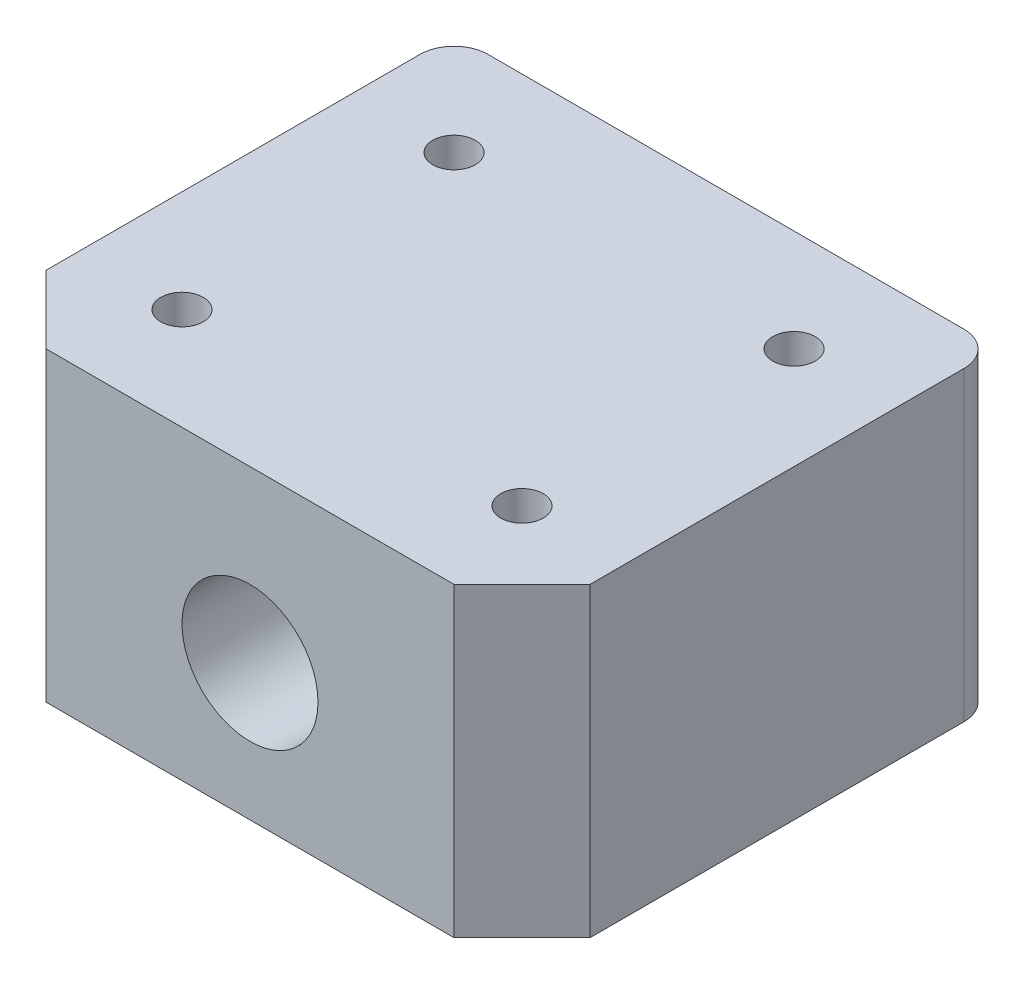
ISO-10303-21;
HEADER;
FILE_DESCRIPTION(('STEP AP214'),'2;1');
FILE_NAME('part.step','',(''),(''),'','','');
FILE_SCHEMA(('AUTOMOTIVE_DESIGN { 1 0 10303 214 1 1 1 1 }'));
ENDSEC;
DATA;
#1=APPLICATION_CONTEXT('core data for automotive mechanical design processes');
#2=APPLICATION_PROTOCOL_DEFINITION('international standard','automotive_design',2000,#1);
#3=PRODUCT_CONTEXT('',#1,'mechanical');
#4=PRODUCT('Part','Part','',(#3));
#5=PRODUCT_RELATED_PRODUCT_CATEGORY('part','',(#4));
#6=PRODUCT_DEFINITION_FORMATION('','',#4);
#7=PRODUCT_DEFINITION_CONTEXT('part definition',#1,'design');
#8=PRODUCT_DEFINITION('design','',#6,#7);
#9=PRODUCT_DEFINITION_SHAPE('','',#8);
#10=(LENGTH_UNIT() NAMED_UNIT(*) SI_UNIT(.MILLI.,.METRE.));
#11=(NAMED_UNIT(*) PLANE_ANGLE_UNIT() SI_UNIT($,.RADIAN.));
#12=(NAMED_UNIT(*) SI_UNIT($,.STERADIAN.) SOLID_ANGLE_UNIT());
#13=UNCERTAINTY_MEASURE_WITH_UNIT(LENGTH_MEASURE(1.E-05),#10,'distance_accuracy_value','');
#14=(GEOMETRIC_REPRESENTATION_CONTEXT(3) GLOBAL_UNCERTAINTY_ASSIGNED_CONTEXT((#13)) GLOBAL_UNIT_ASSIGNED_CONTEXT((#10,
#11,#12)) REPRESENTATION_CONTEXT('',''));
#15=CARTESIAN_POINT('',(0.,0.,0.));
#16=DIRECTION('',(0.,0.,1.));
#17=DIRECTION('',(1.,0.,0.));
#18=AXIS2_PLACEMENT_3D('',#15,#16,#17);
#19=CARTESIAN_POINT('',(-8.,-4.,7.));
#20=DIRECTION('',(0.,0.,1.));
#21=DIRECTION('',(1.,0.,0.));
#22=AXIS2_PLACEMENT_3D('',#19,#20,#21);
#23=PLANE('',#22);
#24=DIRECTION('',(1.,0.,0.));
#25=VECTOR('',#24,1.);
#26=CARTESIAN_POINT('',(-8.,-4.,7.));
#27=LINE('',#26,#25);
#28=CARTESIAN_POINT('',(-6.,-4.,7.));
#29=VERTEX_POINT('',#28);
#30=CARTESIAN_POINT('',(6.00000000000001,-4.,7.));
#31=VERTEX_POINT('',#30);
#32=EDGE_CURVE('E117',#29,#31,#27,.T.);
#33=ORIENTED_EDGE('',*,*,#32,.T.);
#34=DIRECTION('',(0.,1.,0.));
#35=VECTOR('',#34,1.);
#36=CARTESIAN_POINT('',(6.,5.,7.));
#37=LINE('',#36,#35);
#38=CARTESIAN_POINT('',(6.,5.,7.));
#39=VERTEX_POINT('',#38);
#40=EDGE_CURVE('E121',#31,#39,#37,.T.);
#41=ORIENTED_EDGE('',*,*,#40,.T.);
#42=DIRECTION('',(-1.,0.,0.));
#43=VECTOR('',#42,1.);
#44=CARTESIAN_POINT('',(-8.,5.,7.));
#45=LINE('',#44,#43);
#46=CARTESIAN_POINT('',(-6.00000000000001,5.,7.));
#47=VERTEX_POINT('',#46);
#48=EDGE_CURVE('E120',#39,#47,#45,.T.);
#49=ORIENTED_EDGE('',*,*,#48,.T.);
#50=DIRECTION('',(0.,-1.,0.));
#51=VECTOR('',#50,1.);
#52=CARTESIAN_POINT('',(-6.,-4.,7.));
#53=LINE('',#52,#51);
#54=EDGE_CURVE('E103',#47,#29,#53,.T.);
#55=ORIENTED_EDGE('',*,*,#54,.T.);
#56=EDGE_LOOP('',(#33,#41,#49,#55));
#57=FACE_BOUND('',#56,.T.);
#58=CARTESIAN_POINT('',(0.,0.,7.));
#59=DIRECTION('',(0.,0.,1.));
#60=DIRECTION('',(1.,0.,0.));
#61=AXIS2_PLACEMENT_3D('',#58,#59,#60);
#62=CIRCLE('',#61,2.);
#63=CARTESIAN_POINT('',(2.,0.,7.));
#64=VERTEX_POINT('',#63);
#65=EDGE_CURVE('E127',#64,#64,#62,.T.);
#66=ORIENTED_EDGE('',*,*,#65,.F.);
#67=EDGE_LOOP('',(#66));
#68=FACE_BOUND('',#67,.T.);
#69=ADVANCED_FACE('F32',(#57,#68),#23,.T.);
#70=CARTESIAN_POINT('',(-8.,5.,7.));
#71=DIRECTION('',(1.,0.,0.));
#72=DIRECTION('',(0.,1.,0.));
#73=AXIS2_PLACEMENT_3D('',#70,#71,#72);
#74=PLANE('',#73);
#75=DIRECTION('',(0.,0.,-1.));
#76=VECTOR('',#75,1.);
#77=CARTESIAN_POINT('',(-8.,5.,7.));
#78=LINE('',#77,#76);
#79=CARTESIAN_POINT('',(-8.,5.,5.));
#80=VERTEX_POINT('',#79);
#81=CARTESIAN_POINT('',(-8.,5.,-6.));
#82=VERTEX_POINT('',#81);
#83=EDGE_CURVE('E129',#80,#82,#78,.T.);
#84=ORIENTED_EDGE('',*,*,#83,.T.);
#85=DIRECTION('',(0.,-1.,0.));
#86=VECTOR('',#85,1.);
#87=CARTESIAN_POINT('',(-8.,-4.,-6.));
#88=LINE('',#87,#86);
#89=CARTESIAN_POINT('',(-8.,-4.,-6.));
#90=VERTEX_POINT('',#89);
#91=EDGE_CURVE('E153',#82,#90,#88,.T.);
#92=ORIENTED_EDGE('',*,*,#91,.T.);
#93=DIRECTION('',(0.,0.,-1.));
#94=VECTOR('',#93,1.);
#95=CARTESIAN_POINT('',(-8.,-4.,7.));
#96=LINE('',#95,#94);
#97=CARTESIAN_POINT('',(-8.,-4.,5.));
#98=VERTEX_POINT('',#97);
#99=EDGE_CURVE('E122',#98,#90,#96,.T.);
#100=ORIENTED_EDGE('',*,*,#99,.F.);
#101=DIRECTION('',(0.,1.,0.));
#102=VECTOR('',#101,1.);
#103=CARTESIAN_POINT('',(-8.,5.,5.));
#104=LINE('',#103,#102);
#105=EDGE_CURVE('E104',#98,#80,#104,.T.);
#106=ORIENTED_EDGE('',*,*,#105,.T.);
#107=EDGE_LOOP('',(#84,#92,#100,#106));
#108=FACE_BOUND('',#107,.T.);
#109=ADVANCED_FACE('F171',(#108),#74,.F.);
#110=CARTESIAN_POINT('',(-8.,-4.,7.));
#111=DIRECTION('',(0.,1.,0.));
#112=DIRECTION('',(0.,0.,1.));
#113=AXIS2_PLACEMENT_3D('',#110,#111,#112);
#114=PLANE('',#113);
#115=CARTESIAN_POINT('',(-5.,-4.,-4.));
#116=DIRECTION('',(0.,1.,0.));
#117=DIRECTION('',(0.,0.,1.));
#118=AXIS2_PLACEMENT_3D('',#115,#116,#117);
#119=CIRCLE('',#118,0.624999999999998);
#120=CARTESIAN_POINT('',(-5.,-4.,-3.375));
#121=VERTEX_POINT('',#120);
#122=EDGE_CURVE('E245',#121,#121,#119,.T.);
#123=ORIENTED_EDGE('',*,*,#122,.T.);
#124=EDGE_LOOP('',(#123));
#125=FACE_BOUND('',#124,.T.);
#126=CARTESIAN_POINT('',(5.,-4.,-4.));
#127=DIRECTION('',(0.,1.,0.));
#128=DIRECTION('',(0.,0.,1.));
#129=AXIS2_PLACEMENT_3D('',#126,#127,#128);
#130=CIRCLE('',#129,0.624999999999998);
#131=CARTESIAN_POINT('',(5.,-4.,-3.375));
#132=VERTEX_POINT('',#131);
#133=EDGE_CURVE('E254',#132,#132,#130,.T.);
#134=ORIENTED_EDGE('',*,*,#133,.T.);
#135=EDGE_LOOP('',(#134));
#136=FACE_BOUND('',#135,.T.);
#137=CARTESIAN_POINT('',(-5.,-4.,4.));
#138=DIRECTION('',(0.,1.,0.));
#139=DIRECTION('',(0.,0.,1.));
#140=AXIS2_PLACEMENT_3D('',#137,#138,#139);
#141=CIRCLE('',#140,0.624999999999998);
#142=CARTESIAN_POINT('',(-5.,-4.,4.625));
#143=VERTEX_POINT('',#142);
#144=EDGE_CURVE('E180',#143,#143,#141,.T.);
#145=ORIENTED_EDGE('',*,*,#144,.T.);
#146=EDGE_LOOP('',(#145));
#147=FACE_BOUND('',#146,.T.);
#148=CARTESIAN_POINT('',(5.,-4.,4.));
#149=DIRECTION('',(0.,1.,0.));
#150=DIRECTION('',(0.,0.,1.));
#151=AXIS2_PLACEMENT_3D('',#148,#149,#150);
#152=CIRCLE('',#151,0.624999999999998);
#153=CARTESIAN_POINT('',(5.,-4.,4.625));
#154=VERTEX_POINT('',#153);
#155=EDGE_CURVE('E132',#154,#154,#152,.T.);
#156=ORIENTED_EDGE('',*,*,#155,.T.);
#157=EDGE_LOOP('',(#156));
#158=FACE_BOUND('',#157,.T.);
#159=ORIENTED_EDGE('',*,*,#99,.T.);
#160=CARTESIAN_POINT('',(-7.,-4.,-6.));
#161=DIRECTION('',(0.,1.,0.));
#162=DIRECTION('',(0.,0.,1.));
#163=AXIS2_PLACEMENT_3D('',#160,#161,#162);
#164=CIRCLE('',#163,1.);
#165=CARTESIAN_POINT('',(-7.,-4.,-7.));
#166=VERTEX_POINT('',#165);
#167=EDGE_CURVE('E158',#90,#166,#164,.F.);
#168=ORIENTED_EDGE('',*,*,#167,.T.);
#169=DIRECTION('',(1.,0.,0.));
#170=VECTOR('',#169,1.);
#171=CARTESIAN_POINT('',(-8.,-4.,-7.));
#172=LINE('',#171,#170);
#173=CARTESIAN_POINT('',(7.,-4.,-7.));
#174=VERTEX_POINT('',#173);
#175=EDGE_CURVE('E174',#166,#174,#172,.T.);
#176=ORIENTED_EDGE('',*,*,#175,.T.);
#177=CARTESIAN_POINT('',(7.,-4.,-6.));
#178=DIRECTION('',(0.,1.,0.));
#179=DIRECTION('',(0.,0.,1.));
#180=AXIS2_PLACEMENT_3D('',#177,#178,#179);
#181=CIRCLE('',#180,1.);
#182=CARTESIAN_POINT('',(8.,-4.,-6.));
#183=VERTEX_POINT('',#182);
#184=EDGE_CURVE('E156',#174,#183,#181,.F.);
#185=ORIENTED_EDGE('',*,*,#184,.T.);
#186=DIRECTION('',(0.,0.,-1.));
#187=VECTOR('',#186,1.);
#188=CARTESIAN_POINT('',(8.,-4.,7.));
#189=LINE('',#188,#187);
#190=CARTESIAN_POINT('',(8.,-4.,5.));
#191=VERTEX_POINT('',#190);
#192=EDGE_CURVE('E141',#191,#183,#189,.T.);
#193=ORIENTED_EDGE('',*,*,#192,.F.);
#194=DIRECTION('',(-0.707106781186547,0.,0.707106781186548));
#195=VECTOR('',#194,1.);
#196=CARTESIAN_POINT('',(6.00000000000001,-4.,7.));
#197=LINE('',#196,#195);
#198=EDGE_CURVE('E109',#191,#31,#197,.T.);
#199=ORIENTED_EDGE('',*,*,#198,.T.);
#200=ORIENTED_EDGE('',*,*,#32,.F.);
#201=DIRECTION('',(-0.707106781186546,0.,-0.707106781186549));
#202=VECTOR('',#201,1.);
#203=CARTESIAN_POINT('',(-6.,-4.,7.));
#204=LINE('',#203,#202);
#205=EDGE_CURVE('E99',#29,#98,#204,.T.);
#206=ORIENTED_EDGE('',*,*,#205,.T.);
#207=EDGE_LOOP('',(#159,#168,#176,#185,#193,#199,#200,#206));
#208=FACE_BOUND('',#207,.T.);
#209=ADVANCED_FACE('F124',(#125,#136,#147,#158,#208),#114,.F.);
#210=CARTESIAN_POINT('',(8.,5.,7.));
#211=DIRECTION('',(-1.,0.,0.));
#212=DIRECTION('',(0.,-1.,0.));
#213=AXIS2_PLACEMENT_3D('',#210,#211,#212);
#214=PLANE('',#213);
#215=ORIENTED_EDGE('',*,*,#192,.T.);
#216=DIRECTION('',(0.,1.,0.));
#217=VECTOR('',#216,1.);
#218=CARTESIAN_POINT('',(8.,5.,-6.));
#219=LINE('',#218,#217);
#220=CARTESIAN_POINT('',(8.,5.,-6.));
#221=VERTEX_POINT('',#220);
#222=EDGE_CURVE('E11',#183,#221,#219,.T.);
#223=ORIENTED_EDGE('',*,*,#222,.T.);
#224=DIRECTION('',(0.,0.,-1.));
#225=VECTOR('',#224,1.);
#226=CARTESIAN_POINT('',(8.,5.,7.));
#227=LINE('',#226,#225);
#228=CARTESIAN_POINT('',(8.,5.,5.));
#229=VERTEX_POINT('',#228);
#230=EDGE_CURVE('E138',#229,#221,#227,.T.);
#231=ORIENTED_EDGE('',*,*,#230,.F.);
#232=DIRECTION('',(0.,-1.,0.));
#233=VECTOR('',#232,1.);
#234=CARTESIAN_POINT('',(8.,-4.,5.));
#235=LINE('',#234,#233);
#236=EDGE_CURVE('E110',#229,#191,#235,.T.);
#237=ORIENTED_EDGE('',*,*,#236,.T.);
#238=EDGE_LOOP('',(#215,#223,#231,#237));
#239=FACE_BOUND('',#238,.T.);
#240=ADVANCED_FACE('F203',(#239),#214,.F.);
#241=CARTESIAN_POINT('',(-8.,5.,7.));
#242=DIRECTION('',(0.,-1.,0.));
#243=DIRECTION('',(0.,0.,-1.));
#244=AXIS2_PLACEMENT_3D('',#241,#242,#243);
#245=PLANE('',#244);
#246=CARTESIAN_POINT('',(-5.,5.,-4.));
#247=DIRECTION('',(0.,1.,0.));
#248=DIRECTION('',(0.,0.,1.));
#249=AXIS2_PLACEMENT_3D('',#246,#247,#248);
#250=CIRCLE('',#249,0.624999999999988);
#251=CARTESIAN_POINT('',(-5.,5.,-3.37500000000001));
#252=VERTEX_POINT('',#251);
#253=EDGE_CURVE('E247',#252,#252,#250,.T.);
#254=ORIENTED_EDGE('',*,*,#253,.F.);
#255=EDGE_LOOP('',(#254));
#256=FACE_BOUND('',#255,.T.);
#257=CARTESIAN_POINT('',(5.,5.,-4.));
#258=DIRECTION('',(0.,1.,0.));
#259=DIRECTION('',(0.,0.,1.));
#260=AXIS2_PLACEMENT_3D('',#257,#258,#259);
#261=CIRCLE('',#260,0.624999999999988);
#262=CARTESIAN_POINT('',(5.,5.,-3.37500000000001));
#263=VERTEX_POINT('',#262);
#264=EDGE_CURVE('E249',#263,#263,#261,.T.);
#265=ORIENTED_EDGE('',*,*,#264,.F.);
#266=EDGE_LOOP('',(#265));
#267=FACE_BOUND('',#266,.T.);
#268=CARTESIAN_POINT('',(-5.,5.,4.));
#269=DIRECTION('',(0.,1.,0.));
#270=DIRECTION('',(0.,0.,1.));
#271=AXIS2_PLACEMENT_3D('',#268,#269,#270);
#272=CIRCLE('',#271,0.624999999999988);
#273=CARTESIAN_POINT('',(-5.,5.,4.62499999999999));
#274=VERTEX_POINT('',#273);
#275=EDGE_CURVE('E177',#274,#274,#272,.T.);
#276=ORIENTED_EDGE('',*,*,#275,.F.);
#277=EDGE_LOOP('',(#276));
#278=FACE_BOUND('',#277,.T.);
#279=CARTESIAN_POINT('',(5.,5.,4.));
#280=DIRECTION('',(0.,1.,0.));
#281=DIRECTION('',(0.,0.,1.));
#282=AXIS2_PLACEMENT_3D('',#279,#280,#281);
#283=CIRCLE('',#282,0.624999999999988);
#284=CARTESIAN_POINT('',(5.,5.,4.62499999999999));
#285=VERTEX_POINT('',#284);
#286=EDGE_CURVE('E188',#285,#285,#283,.T.);
#287=ORIENTED_EDGE('',*,*,#286,.F.);
#288=EDGE_LOOP('',(#287));
#289=FACE_BOUND('',#288,.T.);
#290=DIRECTION('',(-1.,0.,0.));
#291=VECTOR('',#290,1.);
#292=CARTESIAN_POINT('',(-8.,5.,-7.));
#293=LINE('',#292,#291);
#294=CARTESIAN_POINT('',(7.,5.,-7.));
#295=VERTEX_POINT('',#294);
#296=CARTESIAN_POINT('',(-7.,5.,-7.));
#297=VERTEX_POINT('',#296);
#298=EDGE_CURVE('E167',#295,#297,#293,.T.);
#299=ORIENTED_EDGE('',*,*,#298,.T.);
#300=CARTESIAN_POINT('',(-7.,5.,-6.));
#301=DIRECTION('',(0.,-1.,0.));
#302=DIRECTION('',(0.,0.,-1.));
#303=AXIS2_PLACEMENT_3D('',#300,#301,#302);
#304=CIRCLE('',#303,1.);
#305=EDGE_CURVE('E40',#297,#82,#304,.F.);
#306=ORIENTED_EDGE('',*,*,#305,.T.);
#307=ORIENTED_EDGE('',*,*,#83,.F.);
#308=DIRECTION('',(0.707106781186546,0.,0.707106781186549));
#309=VECTOR('',#308,1.);
#310=CARTESIAN_POINT('',(-6.,5.,7.));
#311=LINE('',#310,#309);
#312=EDGE_CURVE('E146',#80,#47,#311,.T.);
#313=ORIENTED_EDGE('',*,*,#312,.T.);
#314=ORIENTED_EDGE('',*,*,#48,.F.);
#315=DIRECTION('',(0.707106781186547,0.,-0.707106781186548));
#316=VECTOR('',#315,1.);
#317=CARTESIAN_POINT('',(6.,5.,7.));
#318=LINE('',#317,#316);
#319=EDGE_CURVE('E148',#39,#229,#318,.T.);
#320=ORIENTED_EDGE('',*,*,#319,.T.);
#321=ORIENTED_EDGE('',*,*,#230,.T.);
#322=CARTESIAN_POINT('',(7.,5.,-6.));
#323=DIRECTION('',(0.,-1.,0.));
#324=DIRECTION('',(0.,0.,-1.));
#325=AXIS2_PLACEMENT_3D('',#322,#323,#324);
#326=CIRCLE('',#325,1.);
#327=EDGE_CURVE('E47',#221,#295,#326,.F.);
#328=ORIENTED_EDGE('',*,*,#327,.T.);
#329=EDGE_LOOP('',(#299,#306,#307,#313,#314,#320,#321,#328));
#330=FACE_BOUND('',#329,.T.);
#331=ADVANCED_FACE('F166',(#256,#267,#278,#289,#330),#245,.F.);
#332=CARTESIAN_POINT('',(0.,0.,7.));
#333=DIRECTION('',(0.,0.,-1.));
#334=DIRECTION('',(-1.,0.,0.));
#335=AXIS2_PLACEMENT_3D('',#332,#333,#334);
#336=CYLINDRICAL_SURFACE('',#335,2.);
#337=ORIENTED_EDGE('',*,*,#65,.T.);
#338=EDGE_LOOP('',(#337));
#339=FACE_BOUND('',#338,.T.);
#340=CARTESIAN_POINT('',(0.,0.,-7.));
#341=DIRECTION('',(0.,0.,1.));
#342=DIRECTION('',(1.,0.,0.));
#343=AXIS2_PLACEMENT_3D('',#340,#341,#342);
#344=CIRCLE('',#343,2.);
#345=CARTESIAN_POINT('',(2.,0.,-7.));
#346=VERTEX_POINT('',#345);
#347=EDGE_CURVE('E182',#346,#346,#344,.T.);
#348=ORIENTED_EDGE('',*,*,#347,.F.);
#349=EDGE_LOOP('',(#348));
#350=FACE_BOUND('',#349,.T.);
#351=ADVANCED_FACE('F198',(#339,#350),#336,.F.);
#352=CARTESIAN_POINT('',(5.,5.,4.));
#353=DIRECTION('',(0.,1.,0.));
#354=DIRECTION('',(0.,0.,1.));
#355=AXIS2_PLACEMENT_3D('',#352,#353,#354);
#356=CYLINDRICAL_SURFACE('',#355,0.624999999999993);
#357=ORIENTED_EDGE('',*,*,#155,.F.);
#358=EDGE_LOOP('',(#357));
#359=FACE_BOUND('',#358,.T.);
#360=ORIENTED_EDGE('',*,*,#286,.T.);
#361=EDGE_LOOP('',(#360));
#362=FACE_BOUND('',#361,.T.);
#363=ADVANCED_FACE('F194',(#359,#362),#356,.F.);
#364=CARTESIAN_POINT('',(-5.,5.,4.));
#365=DIRECTION('',(0.,1.,0.));
#366=DIRECTION('',(0.,0.,1.));
#367=AXIS2_PLACEMENT_3D('',#364,#365,#366);
#368=CYLINDRICAL_SURFACE('',#367,0.624999999999993);
#369=ORIENTED_EDGE('',*,*,#144,.F.);
#370=EDGE_LOOP('',(#369));
#371=FACE_BOUND('',#370,.T.);
#372=ORIENTED_EDGE('',*,*,#275,.T.);
#373=EDGE_LOOP('',(#372));
#374=FACE_BOUND('',#373,.T.);
#375=ADVANCED_FACE('F197',(#371,#374),#368,.F.);
#376=CARTESIAN_POINT('',(-8.,-4.,-7.));
#377=DIRECTION('',(0.,0.,-1.));
#378=DIRECTION('',(1.,0.,0.));
#379=AXIS2_PLACEMENT_3D('',#376,#377,#378);
#380=PLANE('',#379);
#381=ORIENTED_EDGE('',*,*,#347,.T.);
#382=EDGE_LOOP('',(#381));
#383=FACE_BOUND('',#382,.T.);
#384=ORIENTED_EDGE('',*,*,#175,.F.);
#385=DIRECTION('',(0.,-1.,0.));
#386=VECTOR('',#385,1.);
#387=CARTESIAN_POINT('',(-7.,5.,-7.));
#388=LINE('',#387,#386);
#389=EDGE_CURVE('E54',#166,#297,#388,.F.);
#390=ORIENTED_EDGE('',*,*,#389,.T.);
#391=ORIENTED_EDGE('',*,*,#298,.F.);
#392=DIRECTION('',(0.,1.,0.));
#393=VECTOR('',#392,1.);
#394=CARTESIAN_POINT('',(7.,-4.,-7.));
#395=LINE('',#394,#393);
#396=EDGE_CURVE('E160',#295,#174,#395,.F.);
#397=ORIENTED_EDGE('',*,*,#396,.T.);
#398=EDGE_LOOP('',(#384,#390,#391,#397));
#399=FACE_BOUND('',#398,.T.);
#400=ADVANCED_FACE('F176',(#383,#399),#380,.T.);
#401=CARTESIAN_POINT('',(5.,5.,-4.));
#402=DIRECTION('',(0.,1.,0.));
#403=DIRECTION('',(0.,0.,1.));
#404=AXIS2_PLACEMENT_3D('',#401,#402,#403);
#405=CYLINDRICAL_SURFACE('',#404,0.624999999999993);
#406=ORIENTED_EDGE('',*,*,#133,.F.);
#407=EDGE_LOOP('',(#406));
#408=FACE_BOUND('',#407,.T.);
#409=ORIENTED_EDGE('',*,*,#264,.T.);
#410=EDGE_LOOP('',(#409));
#411=FACE_BOUND('',#410,.T.);
#412=ADVANCED_FACE('F228',(#408,#411),#405,.F.);
#413=CARTESIAN_POINT('',(-5.,5.,-4.));
#414=DIRECTION('',(0.,1.,0.));
#415=DIRECTION('',(0.,0.,1.));
#416=AXIS2_PLACEMENT_3D('',#413,#414,#415);
#417=CYLINDRICAL_SURFACE('',#416,0.624999999999993);
#418=ORIENTED_EDGE('',*,*,#122,.F.);
#419=EDGE_LOOP('',(#418));
#420=FACE_BOUND('',#419,.T.);
#421=ORIENTED_EDGE('',*,*,#253,.T.);
#422=EDGE_LOOP('',(#421));
#423=FACE_BOUND('',#422,.T.);
#424=ADVANCED_FACE('F232',(#420,#423),#417,.F.);
#425=CARTESIAN_POINT('',(6.00000000000001,-3.99999999999999,7.));
#426=DIRECTION('',(0.707106781186548,0.,0.707106781186547));
#427=DIRECTION('',(0.707106781186547,0.,-0.707106781186548));
#428=AXIS2_PLACEMENT_3D('',#425,#426,#427);
#429=PLANE('',#428);
#430=ORIENTED_EDGE('',*,*,#198,.F.);
#431=ORIENTED_EDGE('',*,*,#236,.F.);
#432=ORIENTED_EDGE('',*,*,#319,.F.);
#433=ORIENTED_EDGE('',*,*,#40,.F.);
#434=EDGE_LOOP('',(#430,#431,#432,#433));
#435=FACE_BOUND('',#434,.T.);
#436=ADVANCED_FACE('F235',(#435),#429,.T.);
#437=CARTESIAN_POINT('',(-6.,-4.,7.));
#438=DIRECTION('',(-0.707106781186549,0.,0.707106781186546));
#439=DIRECTION('',(0.707106781186546,0.,0.707106781186549));
#440=AXIS2_PLACEMENT_3D('',#437,#438,#439);
#441=PLANE('',#440);
#442=ORIENTED_EDGE('',*,*,#312,.F.);
#443=ORIENTED_EDGE('',*,*,#105,.F.);
#444=ORIENTED_EDGE('',*,*,#205,.F.);
#445=ORIENTED_EDGE('',*,*,#54,.F.);
#446=EDGE_LOOP('',(#442,#443,#444,#445));
#447=FACE_BOUND('',#446,.T.);
#448=ADVANCED_FACE('F102',(#447),#441,.T.);
#449=CARTESIAN_POINT('',(-7.,5.,-6.));
#450=DIRECTION('',(0.,1.,0.));
#451=DIRECTION('',(-1.,0.,0.));
#452=AXIS2_PLACEMENT_3D('',#449,#450,#451);
#453=CYLINDRICAL_SURFACE('',#452,1.);
#454=ORIENTED_EDGE('',*,*,#305,.F.);
#455=ORIENTED_EDGE('',*,*,#389,.F.);
#456=ORIENTED_EDGE('',*,*,#167,.F.);
#457=ORIENTED_EDGE('',*,*,#91,.F.);
#458=EDGE_LOOP('',(#454,#455,#456,#457));
#459=FACE_BOUND('',#458,.T.);
#460=ADVANCED_FACE('F172',(#459),#453,.T.);
#461=CARTESIAN_POINT('',(7.,5.,-6.));
#462=DIRECTION('',(0.,-1.,0.));
#463=DIRECTION('',(1.,0.,0.));
#464=AXIS2_PLACEMENT_3D('',#461,#462,#463);
#465=CYLINDRICAL_SURFACE('',#464,1.);
#466=ORIENTED_EDGE('',*,*,#184,.F.);
#467=ORIENTED_EDGE('',*,*,#396,.F.);
#468=ORIENTED_EDGE('',*,*,#327,.F.);
#469=ORIENTED_EDGE('',*,*,#222,.F.);
#470=EDGE_LOOP('',(#466,#467,#468,#469));
#471=FACE_BOUND('',#470,.T.);
#472=ADVANCED_FACE('F34',(#471),#465,.T.);
#473=CLOSED_SHELL('',(#69,#109,#209,#240,#331,#351,#363,#375,#400,#412,#424,#436,#448,#460,#472));
#474=MANIFOLD_SOLID_BREP('B2',#473);
#475=ADVANCED_BREP_SHAPE_REPRESENTATION('',(#18,#474),#14);
#476=SHAPE_DEFINITION_REPRESENTATION(#9,#475);
ENDSEC;
END-ISO-10303-21;
